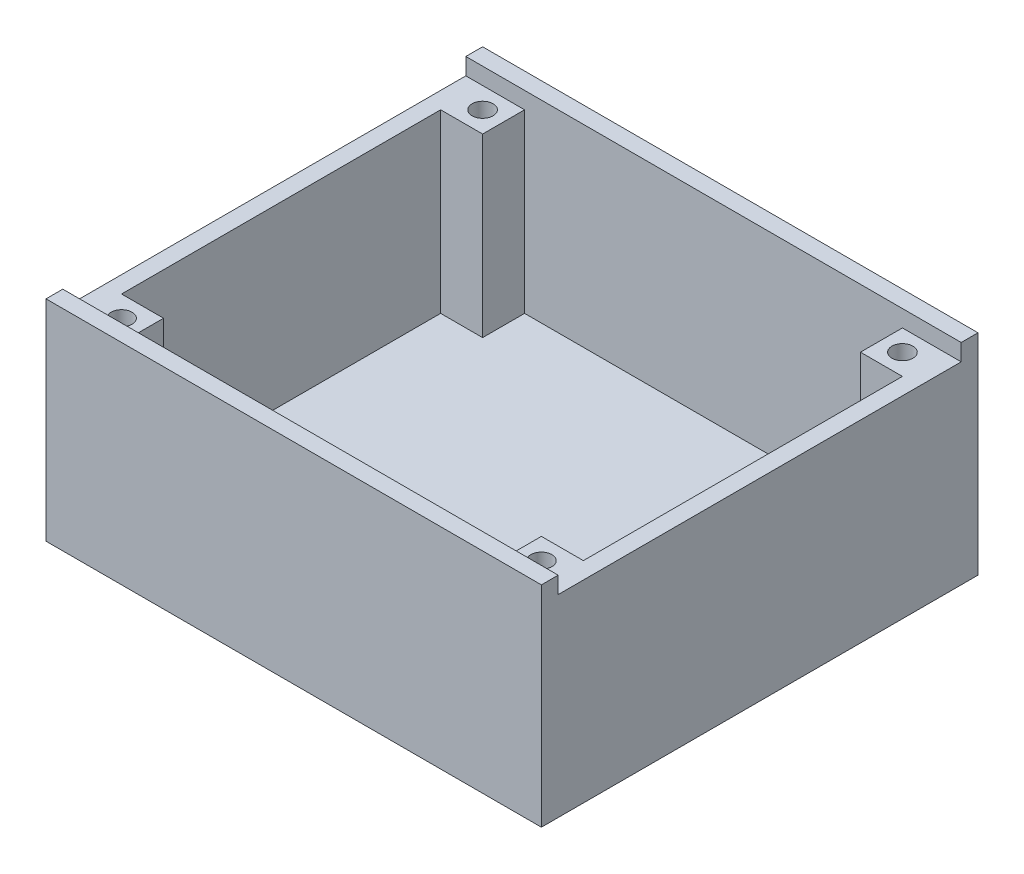
ISO-10303-21;
HEADER;
FILE_DESCRIPTION(('STEP AP214'),'2;1');
FILE_NAME('part.step','',(''),(''),'','','');
FILE_SCHEMA(('AUTOMOTIVE_DESIGN { 1 0 10303 214 1 1 1 1 }'));
ENDSEC;
DATA;
#1=APPLICATION_CONTEXT('core data for automotive mechanical design processes');
#2=APPLICATION_PROTOCOL_DEFINITION('international standard','automotive_design',2000,#1);
#3=PRODUCT_CONTEXT('',#1,'mechanical');
#4=PRODUCT('Part','Part','',(#3));
#5=PRODUCT_RELATED_PRODUCT_CATEGORY('part','',(#4));
#6=PRODUCT_DEFINITION_FORMATION('','',#4);
#7=PRODUCT_DEFINITION_CONTEXT('part definition',#1,'design');
#8=PRODUCT_DEFINITION('design','',#6,#7);
#9=PRODUCT_DEFINITION_SHAPE('','',#8);
#10=(LENGTH_UNIT() NAMED_UNIT(*) SI_UNIT(.MILLI.,.METRE.));
#11=(NAMED_UNIT(*) PLANE_ANGLE_UNIT() SI_UNIT($,.RADIAN.));
#12=(NAMED_UNIT(*) SI_UNIT($,.STERADIAN.) SOLID_ANGLE_UNIT());
#13=UNCERTAINTY_MEASURE_WITH_UNIT(LENGTH_MEASURE(1.E-05),#10,'distance_accuracy_value','');
#14=(GEOMETRIC_REPRESENTATION_CONTEXT(3) GLOBAL_UNCERTAINTY_ASSIGNED_CONTEXT((#13)) GLOBAL_UNIT_ASSIGNED_CONTEXT((#10,
#11,#12)) REPRESENTATION_CONTEXT('',''));
#15=CARTESIAN_POINT('',(0.,0.,0.));
#16=DIRECTION('',(0.,0.,1.));
#17=DIRECTION('',(1.,0.,0.));
#18=AXIS2_PLACEMENT_3D('',#15,#16,#17);
#19=CARTESIAN_POINT('',(0.,4.,0.));
#20=DIRECTION('',(0.,1.,0.));
#21=DIRECTION('',(0.,0.,1.));
#22=AXIS2_PLACEMENT_3D('',#19,#20,#21);
#23=PLANE('',#22);
#24=DIRECTION('',(0.,0.,-1.));
#25=VECTOR('',#24,1.);
#26=CARTESIAN_POINT('',(55.,4.,48.));
#27=LINE('',#26,#25);
#28=CARTESIAN_POINT('',(55.,4.,38.));
#29=VERTEX_POINT('',#28);
#30=CARTESIAN_POINT('',(55.,4.,-38.));
#31=VERTEX_POINT('',#30);
#32=EDGE_CURVE('E200',#29,#31,#27,.T.);
#33=ORIENTED_EDGE('',*,*,#32,.T.);
#34=DIRECTION('',(1.,0.,0.));
#35=VECTOR('',#34,1.);
#36=CARTESIAN_POINT('',(55.,4.,-38.));
#37=LINE('',#36,#35);
#38=CARTESIAN_POINT('',(45.,4.,-38.));
#39=VERTEX_POINT('',#38);
#40=EDGE_CURVE('E193',#39,#31,#37,.T.);
#41=ORIENTED_EDGE('',*,*,#40,.F.);
#42=DIRECTION('',(0.,0.,1.));
#43=VECTOR('',#42,1.);
#44=CARTESIAN_POINT('',(45.,4.,-48.));
#45=LINE('',#44,#43);
#46=CARTESIAN_POINT('',(45.,4.,-48.));
#47=VERTEX_POINT('',#46);
#48=EDGE_CURVE('E179',#47,#39,#45,.T.);
#49=ORIENTED_EDGE('',*,*,#48,.F.);
#50=DIRECTION('',(-1.,0.,0.));
#51=VECTOR('',#50,1.);
#52=CARTESIAN_POINT('',(-55.,4.,-48.));
#53=LINE('',#52,#51);
#54=CARTESIAN_POINT('',(-45.,4.,-48.));
#55=VERTEX_POINT('',#54);
#56=EDGE_CURVE('E191',#47,#55,#53,.T.);
#57=ORIENTED_EDGE('',*,*,#56,.T.);
#58=DIRECTION('',(0.,0.,-1.));
#59=VECTOR('',#58,1.);
#60=CARTESIAN_POINT('',(-45.,4.,-48.));
#61=LINE('',#60,#59);
#62=CARTESIAN_POINT('',(-45.,4.,-38.));
#63=VERTEX_POINT('',#62);
#64=EDGE_CURVE('E303',#63,#55,#61,.T.);
#65=ORIENTED_EDGE('',*,*,#64,.F.);
#66=DIRECTION('',(1.,0.,0.));
#67=VECTOR('',#66,1.);
#68=CARTESIAN_POINT('',(-55.,4.,-38.));
#69=LINE('',#68,#67);
#70=CARTESIAN_POINT('',(-55.,4.,-38.));
#71=VERTEX_POINT('',#70);
#72=EDGE_CURVE('E305',#71,#63,#69,.T.);
#73=ORIENTED_EDGE('',*,*,#72,.F.);
#74=DIRECTION('',(0.,0.,1.));
#75=VECTOR('',#74,1.);
#76=CARTESIAN_POINT('',(-55.,4.,48.));
#77=LINE('',#76,#75);
#78=CARTESIAN_POINT('',(-55.,4.,38.));
#79=VERTEX_POINT('',#78);
#80=EDGE_CURVE('E201',#71,#79,#77,.T.);
#81=ORIENTED_EDGE('',*,*,#80,.T.);
#82=DIRECTION('',(-1.,0.,0.));
#83=VECTOR('',#82,1.);
#84=CARTESIAN_POINT('',(-55.,4.,38.));
#85=LINE('',#84,#83);
#86=CARTESIAN_POINT('',(-45.,4.,38.));
#87=VERTEX_POINT('',#86);
#88=EDGE_CURVE('E320',#87,#79,#85,.T.);
#89=ORIENTED_EDGE('',*,*,#88,.F.);
#90=DIRECTION('',(0.,0.,-1.));
#91=VECTOR('',#90,1.);
#92=CARTESIAN_POINT('',(-45.,4.,48.));
#93=LINE('',#92,#91);
#94=CARTESIAN_POINT('',(-45.,4.,48.));
#95=VERTEX_POINT('',#94);
#96=EDGE_CURVE('E322',#95,#87,#93,.T.);
#97=ORIENTED_EDGE('',*,*,#96,.F.);
#98=DIRECTION('',(1.,0.,0.));
#99=VECTOR('',#98,1.);
#100=CARTESIAN_POINT('',(-55.,4.,48.));
#101=LINE('',#100,#99);
#102=CARTESIAN_POINT('',(45.,4.,48.));
#103=VERTEX_POINT('',#102);
#104=EDGE_CURVE('E11',#95,#103,#101,.T.);
#105=ORIENTED_EDGE('',*,*,#104,.T.);
#106=DIRECTION('',(0.,0.,1.));
#107=VECTOR('',#106,1.);
#108=CARTESIAN_POINT('',(45.,4.,48.));
#109=LINE('',#108,#107);
#110=CARTESIAN_POINT('',(45.,4.,38.));
#111=VERTEX_POINT('',#110);
#112=EDGE_CURVE('E338',#111,#103,#109,.T.);
#113=ORIENTED_EDGE('',*,*,#112,.F.);
#114=DIRECTION('',(-1.,0.,0.));
#115=VECTOR('',#114,1.);
#116=CARTESIAN_POINT('',(55.,4.,38.));
#117=LINE('',#116,#115);
#118=EDGE_CURVE('E340',#29,#111,#117,.T.);
#119=ORIENTED_EDGE('',*,*,#118,.F.);
#120=EDGE_LOOP('',(#33,#41,#49,#57,#65,#73,#81,#89,#97,#105,#113,#119));
#121=FACE_BOUND('',#120,.T.);
#122=ADVANCED_FACE('F35',(#121),#23,.T.);
#123=CARTESIAN_POINT('',(55.,50.,48.));
#124=DIRECTION('',(-1.,0.,0.));
#125=DIRECTION('',(0.,0.,1.));
#126=AXIS2_PLACEMENT_3D('',#123,#124,#125);
#127=PLANE('',#126);
#128=DIRECTION('',(0.,0.,1.));
#129=VECTOR('',#128,1.);
#130=CARTESIAN_POINT('',(55.,46.,48.));
#131=LINE('',#130,#129);
#132=CARTESIAN_POINT('',(55.,46.,-38.));
#133=VERTEX_POINT('',#132);
#134=CARTESIAN_POINT('',(55.,46.,38.));
#135=VERTEX_POINT('',#134);
#136=EDGE_CURVE('E278',#133,#135,#131,.T.);
#137=ORIENTED_EDGE('',*,*,#136,.F.);
#138=DIRECTION('',(0.,-1.,0.));
#139=VECTOR('',#138,1.);
#140=CARTESIAN_POINT('',(55.,60.142135623731,-38.));
#141=LINE('',#140,#139);
#142=EDGE_CURVE('E50',#133,#31,#141,.T.);
#143=ORIENTED_EDGE('',*,*,#142,.T.);
#144=ORIENTED_EDGE('',*,*,#32,.F.);
#145=DIRECTION('',(0.,-1.,0.));
#146=VECTOR('',#145,1.);
#147=CARTESIAN_POINT('',(55.,60.142135623731,38.));
#148=LINE('',#147,#146);
#149=EDGE_CURVE('E331',#135,#29,#148,.T.);
#150=ORIENTED_EDGE('',*,*,#149,.F.);
#151=EDGE_LOOP('',(#137,#143,#144,#150));
#152=FACE_BOUND('',#151,.T.);
#153=ADVANCED_FACE('F424',(#152),#127,.T.);
#154=CARTESIAN_POINT('',(-55.,50.,-48.));
#155=DIRECTION('',(0.,0.,1.));
#156=DIRECTION('',(1.,0.,0.));
#157=AXIS2_PLACEMENT_3D('',#154,#155,#156);
#158=PLANE('',#157);
#159=ORIENTED_EDGE('',*,*,#56,.F.);
#160=DIRECTION('',(0.,-1.,0.));
#161=VECTOR('',#160,1.);
#162=CARTESIAN_POINT('',(45.,60.142135623731,-48.));
#163=LINE('',#162,#161);
#164=CARTESIAN_POINT('',(45.,46.,-48.));
#165=VERTEX_POINT('',#164);
#166=EDGE_CURVE('E175',#165,#47,#163,.T.);
#167=ORIENTED_EDGE('',*,*,#166,.F.);
#168=DIRECTION('',(1.,0.,0.));
#169=VECTOR('',#168,1.);
#170=CARTESIAN_POINT('',(-59.,46.,-48.));
#171=LINE('',#170,#169);
#172=CARTESIAN_POINT('',(59.,46.,-48.));
#173=VERTEX_POINT('',#172);
#174=EDGE_CURVE('E287',#165,#173,#171,.T.);
#175=ORIENTED_EDGE('',*,*,#174,.T.);
#176=DIRECTION('',(0.,-1.,0.));
#177=VECTOR('',#176,1.);
#178=CARTESIAN_POINT('',(59.,50.,-48.));
#179=LINE('',#178,#177);
#180=CARTESIAN_POINT('',(59.,50.,-48.));
#181=VERTEX_POINT('',#180);
#182=EDGE_CURVE('E275',#181,#173,#179,.T.);
#183=ORIENTED_EDGE('',*,*,#182,.F.);
#184=DIRECTION('',(-1.,0.,0.));
#185=VECTOR('',#184,1.);
#186=CARTESIAN_POINT('',(-55.,50.,-48.));
#187=LINE('',#186,#185);
#188=CARTESIAN_POINT('',(-59.,50.,-48.));
#189=VERTEX_POINT('',#188);
#190=EDGE_CURVE('E203',#181,#189,#187,.T.);
#191=ORIENTED_EDGE('',*,*,#190,.T.);
#192=DIRECTION('',(0.,1.,0.));
#193=VECTOR('',#192,1.);
#194=CARTESIAN_POINT('',(-59.,50.,-48.));
#195=LINE('',#194,#193);
#196=CARTESIAN_POINT('',(-59.,46.,-48.));
#197=VERTEX_POINT('',#196);
#198=EDGE_CURVE('E270',#197,#189,#195,.T.);
#199=ORIENTED_EDGE('',*,*,#198,.F.);
#200=CARTESIAN_POINT('',(-45.,46.,-48.));
#201=VERTEX_POINT('',#200);
#202=EDGE_CURVE('E284',#197,#201,#171,.T.);
#203=ORIENTED_EDGE('',*,*,#202,.T.);
#204=DIRECTION('',(0.,-1.,0.));
#205=VECTOR('',#204,1.);
#206=CARTESIAN_POINT('',(-45.,60.142135623731,-48.));
#207=LINE('',#206,#205);
#208=EDGE_CURVE('E199',#201,#55,#207,.T.);
#209=ORIENTED_EDGE('',*,*,#208,.T.);
#210=EDGE_LOOP('',(#159,#167,#175,#183,#191,#199,#203,#209));
#211=FACE_BOUND('',#210,.T.);
#212=ADVANCED_FACE('F197',(#211),#158,.T.);
#213=CARTESIAN_POINT('',(-55.,50.,48.));
#214=DIRECTION('',(0.,0.,-1.));
#215=DIRECTION('',(-1.,0.,0.));
#216=AXIS2_PLACEMENT_3D('',#213,#214,#215);
#217=PLANE('',#216);
#218=DIRECTION('',(1.,0.,0.));
#219=VECTOR('',#218,1.);
#220=CARTESIAN_POINT('',(-59.,46.,48.));
#221=LINE('',#220,#219);
#222=CARTESIAN_POINT('',(45.,46.,48.));
#223=VERTEX_POINT('',#222);
#224=CARTESIAN_POINT('',(59.,46.,48.));
#225=VERTEX_POINT('',#224);
#226=EDGE_CURVE('E288',#223,#225,#221,.T.);
#227=ORIENTED_EDGE('',*,*,#226,.F.);
#228=DIRECTION('',(0.,-1.,0.));
#229=VECTOR('',#228,1.);
#230=CARTESIAN_POINT('',(45.,60.142135623731,48.));
#231=LINE('',#230,#229);
#232=EDGE_CURVE('E335',#223,#103,#231,.T.);
#233=ORIENTED_EDGE('',*,*,#232,.T.);
#234=ORIENTED_EDGE('',*,*,#104,.F.);
#235=DIRECTION('',(0.,-1.,0.));
#236=VECTOR('',#235,1.);
#237=CARTESIAN_POINT('',(-45.,60.142135623731,48.));
#238=LINE('',#237,#236);
#239=CARTESIAN_POINT('',(-45.,46.,48.));
#240=VERTEX_POINT('',#239);
#241=EDGE_CURVE('E315',#240,#95,#238,.T.);
#242=ORIENTED_EDGE('',*,*,#241,.F.);
#243=CARTESIAN_POINT('',(-59.,46.,48.));
#244=VERTEX_POINT('',#243);
#245=EDGE_CURVE('E285',#244,#240,#221,.T.);
#246=ORIENTED_EDGE('',*,*,#245,.F.);
#247=DIRECTION('',(0.,-1.,0.));
#248=VECTOR('',#247,1.);
#249=CARTESIAN_POINT('',(-59.,50.,48.));
#250=LINE('',#249,#248);
#251=CARTESIAN_POINT('',(-59.,50.,48.));
#252=VERTEX_POINT('',#251);
#253=EDGE_CURVE('E293',#252,#244,#250,.T.);
#254=ORIENTED_EDGE('',*,*,#253,.F.);
#255=DIRECTION('',(1.,0.,0.));
#256=VECTOR('',#255,1.);
#257=CARTESIAN_POINT('',(-55.,50.,48.));
#258=LINE('',#257,#256);
#259=CARTESIAN_POINT('',(59.,50.,48.));
#260=VERTEX_POINT('',#259);
#261=EDGE_CURVE('E211',#252,#260,#258,.T.);
#262=ORIENTED_EDGE('',*,*,#261,.T.);
#263=DIRECTION('',(0.,1.,0.));
#264=VECTOR('',#263,1.);
#265=CARTESIAN_POINT('',(59.,50.,48.));
#266=LINE('',#265,#264);
#267=EDGE_CURVE('E206',#225,#260,#266,.T.);
#268=ORIENTED_EDGE('',*,*,#267,.F.);
#269=EDGE_LOOP('',(#227,#233,#234,#242,#246,#254,#262,#268));
#270=FACE_BOUND('',#269,.T.);
#271=ADVANCED_FACE('F393',(#270),#217,.T.);
#272=CARTESIAN_POINT('',(-55.,50.,48.));
#273=DIRECTION('',(1.,0.,0.));
#274=DIRECTION('',(0.,0.,-1.));
#275=AXIS2_PLACEMENT_3D('',#272,#273,#274);
#276=PLANE('',#275);
#277=DIRECTION('',(0.,0.,-1.));
#278=VECTOR('',#277,1.);
#279=CARTESIAN_POINT('',(-55.,46.,48.));
#280=LINE('',#279,#278);
#281=CARTESIAN_POINT('',(-55.,46.,38.));
#282=VERTEX_POINT('',#281);
#283=CARTESIAN_POINT('',(-55.,46.,-38.));
#284=VERTEX_POINT('',#283);
#285=EDGE_CURVE('E282',#282,#284,#280,.T.);
#286=ORIENTED_EDGE('',*,*,#285,.F.);
#287=DIRECTION('',(0.,-1.,0.));
#288=VECTOR('',#287,1.);
#289=CARTESIAN_POINT('',(-55.,60.142135623731,38.));
#290=LINE('',#289,#288);
#291=EDGE_CURVE('E58',#282,#79,#290,.T.);
#292=ORIENTED_EDGE('',*,*,#291,.T.);
#293=ORIENTED_EDGE('',*,*,#80,.F.);
#294=DIRECTION('',(0.,-1.,0.));
#295=VECTOR('',#294,1.);
#296=CARTESIAN_POINT('',(-55.,60.142135623731,-38.));
#297=LINE('',#296,#295);
#298=EDGE_CURVE('E297',#284,#71,#297,.T.);
#299=ORIENTED_EDGE('',*,*,#298,.F.);
#300=EDGE_LOOP('',(#286,#292,#293,#299));
#301=FACE_BOUND('',#300,.T.);
#302=ADVANCED_FACE('F411',(#301),#276,.T.);
#303=CARTESIAN_POINT('',(0.,50.,0.));
#304=DIRECTION('',(0.,-1.,0.));
#305=DIRECTION('',(0.,0.,-1.));
#306=AXIS2_PLACEMENT_3D('',#303,#304,#305);
#307=PLANE('',#306);
#308=DIRECTION('',(0.,0.,-1.));
#309=VECTOR('',#308,1.);
#310=CARTESIAN_POINT('',(59.,50.,52.));
#311=LINE('',#310,#309);
#312=CARTESIAN_POINT('',(59.,50.,52.));
#313=VERTEX_POINT('',#312);
#314=EDGE_CURVE('E214',#313,#260,#311,.T.);
#315=ORIENTED_EDGE('',*,*,#314,.T.);
#316=ORIENTED_EDGE('',*,*,#261,.F.);
#317=DIRECTION('',(0.,0.,1.));
#318=VECTOR('',#317,1.);
#319=CARTESIAN_POINT('',(-59.,50.,52.));
#320=LINE('',#319,#318);
#321=CARTESIAN_POINT('',(-59.,50.,52.));
#322=VERTEX_POINT('',#321);
#323=EDGE_CURVE('E220',#252,#322,#320,.T.);
#324=ORIENTED_EDGE('',*,*,#323,.T.);
#325=DIRECTION('',(1.,0.,0.));
#326=VECTOR('',#325,1.);
#327=CARTESIAN_POINT('',(-59.,50.,52.));
#328=LINE('',#327,#326);
#329=EDGE_CURVE('E224',#322,#313,#328,.T.);
#330=ORIENTED_EDGE('',*,*,#329,.T.);
#331=EDGE_LOOP('',(#315,#316,#324,#330));
#332=FACE_BOUND('',#331,.T.);
#333=ADVANCED_FACE('F397',(#332),#307,.F.);
#334=CARTESIAN_POINT('',(-59.,50.,-52.));
#335=VERTEX_POINT('',#334);
#336=EDGE_CURVE('E221',#335,#189,#320,.T.);
#337=ORIENTED_EDGE('',*,*,#336,.T.);
#338=ORIENTED_EDGE('',*,*,#190,.F.);
#339=CARTESIAN_POINT('',(59.,50.,-52.));
#340=VERTEX_POINT('',#339);
#341=EDGE_CURVE('E218',#181,#340,#311,.T.);
#342=ORIENTED_EDGE('',*,*,#341,.T.);
#343=DIRECTION('',(-1.,0.,0.));
#344=VECTOR('',#343,1.);
#345=CARTESIAN_POINT('',(-59.,50.,-52.));
#346=LINE('',#345,#344);
#347=EDGE_CURVE('E217',#340,#335,#346,.T.);
#348=ORIENTED_EDGE('',*,*,#347,.T.);
#349=EDGE_LOOP('',(#337,#338,#342,#348));
#350=FACE_BOUND('',#349,.T.);
#351=ADVANCED_FACE('F272',(#350),#307,.F.);
#352=CARTESIAN_POINT('',(0.,0.,0.));
#353=DIRECTION('',(0.,-1.,0.));
#354=DIRECTION('',(0.,0.,-1.));
#355=AXIS2_PLACEMENT_3D('',#352,#353,#354);
#356=PLANE('',#355);
#357=DIRECTION('',(0.,0.,-1.));
#358=VECTOR('',#357,1.);
#359=CARTESIAN_POINT('',(59.,0.,52.));
#360=LINE('',#359,#358);
#361=CARTESIAN_POINT('',(59.,0.,52.));
#362=VERTEX_POINT('',#361);
#363=CARTESIAN_POINT('',(59.,0.,-52.));
#364=VERTEX_POINT('',#363);
#365=EDGE_CURVE('E213',#362,#364,#360,.T.);
#366=ORIENTED_EDGE('',*,*,#365,.F.);
#367=DIRECTION('',(1.,0.,0.));
#368=VECTOR('',#367,1.);
#369=CARTESIAN_POINT('',(-59.,0.,52.));
#370=LINE('',#369,#368);
#371=CARTESIAN_POINT('',(-59.,0.,52.));
#372=VERTEX_POINT('',#371);
#373=EDGE_CURVE('E235',#372,#362,#370,.T.);
#374=ORIENTED_EDGE('',*,*,#373,.F.);
#375=DIRECTION('',(0.,0.,1.));
#376=VECTOR('',#375,1.);
#377=CARTESIAN_POINT('',(-59.,0.,52.));
#378=LINE('',#377,#376);
#379=CARTESIAN_POINT('',(-59.,0.,-52.));
#380=VERTEX_POINT('',#379);
#381=EDGE_CURVE('E232',#380,#372,#378,.T.);
#382=ORIENTED_EDGE('',*,*,#381,.F.);
#383=DIRECTION('',(-1.,0.,0.));
#384=VECTOR('',#383,1.);
#385=CARTESIAN_POINT('',(-59.,0.,-52.));
#386=LINE('',#385,#384);
#387=EDGE_CURVE('E229',#364,#380,#386,.T.);
#388=ORIENTED_EDGE('',*,*,#387,.F.);
#389=EDGE_LOOP('',(#366,#374,#382,#388));
#390=FACE_BOUND('',#389,.T.);
#391=ADVANCED_FACE('F253',(#390),#356,.T.);
#392=CARTESIAN_POINT('',(59.,50.,52.));
#393=DIRECTION('',(-1.,0.,0.));
#394=DIRECTION('',(0.,0.,1.));
#395=AXIS2_PLACEMENT_3D('',#392,#393,#394);
#396=PLANE('',#395);
#397=DIRECTION('',(0.,0.,1.));
#398=VECTOR('',#397,1.);
#399=CARTESIAN_POINT('',(59.,46.,52.));
#400=LINE('',#399,#398);
#401=EDGE_CURVE('E276',#173,#225,#400,.T.);
#402=ORIENTED_EDGE('',*,*,#401,.T.);
#403=ORIENTED_EDGE('',*,*,#267,.T.);
#404=ORIENTED_EDGE('',*,*,#314,.F.);
#405=DIRECTION('',(0.,-1.,0.));
#406=VECTOR('',#405,1.);
#407=CARTESIAN_POINT('',(59.,50.,52.));
#408=LINE('',#407,#406);
#409=EDGE_CURVE('E226',#313,#362,#408,.T.);
#410=ORIENTED_EDGE('',*,*,#409,.T.);
#411=ORIENTED_EDGE('',*,*,#365,.T.);
#412=DIRECTION('',(0.,-1.,0.));
#413=VECTOR('',#412,1.);
#414=CARTESIAN_POINT('',(59.,50.,-52.));
#415=LINE('',#414,#413);
#416=EDGE_CURVE('E43',#340,#364,#415,.T.);
#417=ORIENTED_EDGE('',*,*,#416,.F.);
#418=ORIENTED_EDGE('',*,*,#341,.F.);
#419=ORIENTED_EDGE('',*,*,#182,.T.);
#420=EDGE_LOOP('',(#402,#403,#404,#410,#411,#417,#418,#419));
#421=FACE_BOUND('',#420,.T.);
#422=ADVANCED_FACE('F37',(#421),#396,.F.);
#423=CARTESIAN_POINT('',(-59.,50.,-52.));
#424=DIRECTION('',(0.,0.,1.));
#425=DIRECTION('',(1.,0.,0.));
#426=AXIS2_PLACEMENT_3D('',#423,#424,#425);
#427=PLANE('',#426);
#428=ORIENTED_EDGE('',*,*,#416,.T.);
#429=ORIENTED_EDGE('',*,*,#387,.T.);
#430=DIRECTION('',(0.,-1.,0.));
#431=VECTOR('',#430,1.);
#432=CARTESIAN_POINT('',(-59.,50.,-52.));
#433=LINE('',#432,#431);
#434=EDGE_CURVE('E241',#335,#380,#433,.T.);
#435=ORIENTED_EDGE('',*,*,#434,.F.);
#436=ORIENTED_EDGE('',*,*,#347,.F.);
#437=EDGE_LOOP('',(#428,#429,#435,#436));
#438=FACE_BOUND('',#437,.T.);
#439=ADVANCED_FACE('F246',(#438),#427,.F.);
#440=CARTESIAN_POINT('',(-59.,50.,52.));
#441=DIRECTION('',(1.,0.,0.));
#442=DIRECTION('',(0.,0.,-1.));
#443=AXIS2_PLACEMENT_3D('',#440,#441,#442);
#444=PLANE('',#443);
#445=ORIENTED_EDGE('',*,*,#323,.F.);
#446=ORIENTED_EDGE('',*,*,#253,.T.);
#447=DIRECTION('',(0.,0.,-1.));
#448=VECTOR('',#447,1.);
#449=CARTESIAN_POINT('',(-59.,46.,48.));
#450=LINE('',#449,#448);
#451=EDGE_CURVE('E291',#244,#197,#450,.T.);
#452=ORIENTED_EDGE('',*,*,#451,.T.);
#453=ORIENTED_EDGE('',*,*,#198,.T.);
#454=ORIENTED_EDGE('',*,*,#336,.F.);
#455=ORIENTED_EDGE('',*,*,#434,.T.);
#456=ORIENTED_EDGE('',*,*,#381,.T.);
#457=DIRECTION('',(0.,-1.,0.));
#458=VECTOR('',#457,1.);
#459=CARTESIAN_POINT('',(-59.,50.,52.));
#460=LINE('',#459,#458);
#461=EDGE_CURVE('E239',#322,#372,#460,.T.);
#462=ORIENTED_EDGE('',*,*,#461,.F.);
#463=EDGE_LOOP('',(#445,#446,#452,#453,#454,#455,#456,#462));
#464=FACE_BOUND('',#463,.T.);
#465=ADVANCED_FACE('F265',(#464),#444,.F.);
#466=CARTESIAN_POINT('',(-59.,50.,52.));
#467=DIRECTION('',(0.,0.,-1.));
#468=DIRECTION('',(-1.,0.,0.));
#469=AXIS2_PLACEMENT_3D('',#466,#467,#468);
#470=PLANE('',#469);
#471=ORIENTED_EDGE('',*,*,#461,.T.);
#472=ORIENTED_EDGE('',*,*,#373,.T.);
#473=ORIENTED_EDGE('',*,*,#409,.F.);
#474=ORIENTED_EDGE('',*,*,#329,.F.);
#475=EDGE_LOOP('',(#471,#472,#473,#474));
#476=FACE_BOUND('',#475,.T.);
#477=ADVANCED_FACE('F261',(#476),#470,.F.);
#478=CARTESIAN_POINT('',(-59.,46.,48.));
#479=DIRECTION('',(0.,-1.,0.));
#480=DIRECTION('',(0.,0.,-1.));
#481=AXIS2_PLACEMENT_3D('',#478,#479,#480);
#482=PLANE('',#481);
#483=CARTESIAN_POINT('',(-50.,46.,43.));
#484=DIRECTION('',(0.,1.,0.));
#485=DIRECTION('',(0.,0.,-1.));
#486=AXIS2_PLACEMENT_3D('',#483,#484,#485);
#487=CIRCLE('',#486,2.5);
#488=CARTESIAN_POINT('',(-50.,46.,40.5));
#489=VERTEX_POINT('',#488);
#490=EDGE_CURVE('E356',#489,#489,#487,.T.);
#491=ORIENTED_EDGE('',*,*,#490,.F.);
#492=EDGE_LOOP('',(#491));
#493=FACE_BOUND('',#492,.T.);
#494=CARTESIAN_POINT('',(-50.,46.,-43.));
#495=DIRECTION('',(0.,1.,0.));
#496=DIRECTION('',(0.,0.,1.));
#497=AXIS2_PLACEMENT_3D('',#494,#495,#496);
#498=CIRCLE('',#497,2.5);
#499=CARTESIAN_POINT('',(-50.,46.,-40.5));
#500=VERTEX_POINT('',#499);
#501=EDGE_CURVE('E350',#500,#500,#498,.T.);
#502=ORIENTED_EDGE('',*,*,#501,.F.);
#503=EDGE_LOOP('',(#502));
#504=FACE_BOUND('',#503,.T.);
#505=ORIENTED_EDGE('',*,*,#245,.T.);
#506=DIRECTION('',(0.,0.,1.));
#507=VECTOR('',#506,1.);
#508=CARTESIAN_POINT('',(-45.,46.,48.));
#509=LINE('',#508,#507);
#510=CARTESIAN_POINT('',(-45.,46.,38.));
#511=VERTEX_POINT('',#510);
#512=EDGE_CURVE('E308',#511,#240,#509,.T.);
#513=ORIENTED_EDGE('',*,*,#512,.F.);
#514=DIRECTION('',(1.,0.,0.));
#515=VECTOR('',#514,1.);
#516=CARTESIAN_POINT('',(-55.,46.,38.));
#517=LINE('',#516,#515);
#518=EDGE_CURVE('E313',#282,#511,#517,.T.);
#519=ORIENTED_EDGE('',*,*,#518,.F.);
#520=ORIENTED_EDGE('',*,*,#285,.T.);
#521=DIRECTION('',(-1.,0.,0.));
#522=VECTOR('',#521,1.);
#523=CARTESIAN_POINT('',(-55.,46.,-38.));
#524=LINE('',#523,#522);
#525=CARTESIAN_POINT('',(-45.,46.,-38.));
#526=VERTEX_POINT('',#525);
#527=EDGE_CURVE('E296',#526,#284,#524,.T.);
#528=ORIENTED_EDGE('',*,*,#527,.F.);
#529=DIRECTION('',(0.,0.,1.));
#530=VECTOR('',#529,1.);
#531=CARTESIAN_POINT('',(-45.,46.,-48.));
#532=LINE('',#531,#530);
#533=EDGE_CURVE('E299',#201,#526,#532,.T.);
#534=ORIENTED_EDGE('',*,*,#533,.F.);
#535=ORIENTED_EDGE('',*,*,#202,.F.);
#536=ORIENTED_EDGE('',*,*,#451,.F.);
#537=EDGE_LOOP('',(#505,#513,#519,#520,#528,#534,#535,#536));
#538=FACE_BOUND('',#537,.T.);
#539=ADVANCED_FACE('F386',(#493,#504,#538),#482,.F.);
#540=CARTESIAN_POINT('',(50.,46.,43.));
#541=DIRECTION('',(0.,1.,0.));
#542=DIRECTION('',(0.,0.,1.));
#543=AXIS2_PLACEMENT_3D('',#540,#541,#542);
#544=CIRCLE('',#543,2.5);
#545=CARTESIAN_POINT('',(50.,46.,45.5));
#546=VERTEX_POINT('',#545);
#547=EDGE_CURVE('E362',#546,#546,#544,.T.);
#548=ORIENTED_EDGE('',*,*,#547,.F.);
#549=EDGE_LOOP('',(#548));
#550=FACE_BOUND('',#549,.T.);
#551=CARTESIAN_POINT('',(50.,46.,-43.));
#552=DIRECTION('',(0.,1.,0.));
#553=DIRECTION('',(0.,0.,-1.));
#554=AXIS2_PLACEMENT_3D('',#551,#552,#553);
#555=CIRCLE('',#554,2.5);
#556=CARTESIAN_POINT('',(50.,46.,-45.5));
#557=VERTEX_POINT('',#556);
#558=EDGE_CURVE('E368',#557,#557,#555,.T.);
#559=ORIENTED_EDGE('',*,*,#558,.F.);
#560=EDGE_LOOP('',(#559));
#561=FACE_BOUND('',#560,.T.);
#562=ORIENTED_EDGE('',*,*,#174,.F.);
#563=DIRECTION('',(0.,0.,-1.));
#564=VECTOR('',#563,1.);
#565=CARTESIAN_POINT('',(45.,46.,-48.));
#566=LINE('',#565,#564);
#567=CARTESIAN_POINT('',(45.,46.,-38.));
#568=VERTEX_POINT('',#567);
#569=EDGE_CURVE('E181',#568,#165,#566,.T.);
#570=ORIENTED_EDGE('',*,*,#569,.F.);
#571=DIRECTION('',(-1.,0.,0.));
#572=VECTOR('',#571,1.);
#573=CARTESIAN_POINT('',(55.,46.,-38.));
#574=LINE('',#573,#572);
#575=EDGE_CURVE('E185',#133,#568,#574,.T.);
#576=ORIENTED_EDGE('',*,*,#575,.F.);
#577=ORIENTED_EDGE('',*,*,#136,.T.);
#578=DIRECTION('',(1.,0.,0.));
#579=VECTOR('',#578,1.);
#580=CARTESIAN_POINT('',(55.,46.,38.));
#581=LINE('',#580,#579);
#582=CARTESIAN_POINT('',(45.,46.,38.));
#583=VERTEX_POINT('',#582);
#584=EDGE_CURVE('E325',#583,#135,#581,.T.);
#585=ORIENTED_EDGE('',*,*,#584,.F.);
#586=DIRECTION('',(0.,0.,-1.));
#587=VECTOR('',#586,1.);
#588=CARTESIAN_POINT('',(45.,46.,48.));
#589=LINE('',#588,#587);
#590=EDGE_CURVE('E328',#223,#583,#589,.T.);
#591=ORIENTED_EDGE('',*,*,#590,.F.);
#592=ORIENTED_EDGE('',*,*,#226,.T.);
#593=ORIENTED_EDGE('',*,*,#401,.F.);
#594=EDGE_LOOP('',(#562,#570,#576,#577,#585,#591,#592,#593));
#595=FACE_BOUND('',#594,.T.);
#596=ADVANCED_FACE('F382',(#550,#561,#595),#482,.F.);
#597=CARTESIAN_POINT('',(-45.,60.142135623731,-48.));
#598=DIRECTION('',(-1.,0.,0.));
#599=DIRECTION('',(0.,0.,1.));
#600=AXIS2_PLACEMENT_3D('',#597,#598,#599);
#601=PLANE('',#600);
#602=ORIENTED_EDGE('',*,*,#208,.F.);
#603=ORIENTED_EDGE('',*,*,#533,.T.);
#604=DIRECTION('',(0.,-1.,0.));
#605=VECTOR('',#604,1.);
#606=CARTESIAN_POINT('',(-45.,60.142135623731,-38.));
#607=LINE('',#606,#605);
#608=EDGE_CURVE('E300',#526,#63,#607,.T.);
#609=ORIENTED_EDGE('',*,*,#608,.T.);
#610=ORIENTED_EDGE('',*,*,#64,.T.);
#611=EDGE_LOOP('',(#602,#603,#609,#610));
#612=FACE_BOUND('',#611,.T.);
#613=ADVANCED_FACE('F385',(#612),#601,.F.);
#614=CARTESIAN_POINT('',(-55.,60.142135623731,-38.));
#615=DIRECTION('',(0.,0.,-1.));
#616=DIRECTION('',(-1.,0.,0.));
#617=AXIS2_PLACEMENT_3D('',#614,#615,#616);
#618=PLANE('',#617);
#619=ORIENTED_EDGE('',*,*,#608,.F.);
#620=ORIENTED_EDGE('',*,*,#527,.T.);
#621=ORIENTED_EDGE('',*,*,#298,.T.);
#622=ORIENTED_EDGE('',*,*,#72,.T.);
#623=EDGE_LOOP('',(#619,#620,#621,#622));
#624=FACE_BOUND('',#623,.T.);
#625=ADVANCED_FACE('F412',(#624),#618,.F.);
#626=CARTESIAN_POINT('',(-55.,60.142135623731,38.));
#627=DIRECTION('',(0.,0.,1.));
#628=DIRECTION('',(1.,0.,0.));
#629=AXIS2_PLACEMENT_3D('',#626,#627,#628);
#630=PLANE('',#629);
#631=ORIENTED_EDGE('',*,*,#291,.F.);
#632=ORIENTED_EDGE('',*,*,#518,.T.);
#633=DIRECTION('',(0.,-1.,0.));
#634=VECTOR('',#633,1.);
#635=CARTESIAN_POINT('',(-45.,60.142135623731,38.));
#636=LINE('',#635,#634);
#637=EDGE_CURVE('E317',#511,#87,#636,.T.);
#638=ORIENTED_EDGE('',*,*,#637,.T.);
#639=ORIENTED_EDGE('',*,*,#88,.T.);
#640=EDGE_LOOP('',(#631,#632,#638,#639));
#641=FACE_BOUND('',#640,.T.);
#642=ADVANCED_FACE('F414',(#641),#630,.F.);
#643=CARTESIAN_POINT('',(-45.,60.142135623731,48.));
#644=DIRECTION('',(-1.,0.,0.));
#645=DIRECTION('',(0.,0.,1.));
#646=AXIS2_PLACEMENT_3D('',#643,#644,#645);
#647=PLANE('',#646);
#648=ORIENTED_EDGE('',*,*,#637,.F.);
#649=ORIENTED_EDGE('',*,*,#512,.T.);
#650=ORIENTED_EDGE('',*,*,#241,.T.);
#651=ORIENTED_EDGE('',*,*,#96,.T.);
#652=EDGE_LOOP('',(#648,#649,#650,#651));
#653=FACE_BOUND('',#652,.T.);
#654=ADVANCED_FACE('F420',(#653),#647,.F.);
#655=CARTESIAN_POINT('',(45.,60.142135623731,48.));
#656=DIRECTION('',(1.,0.,0.));
#657=DIRECTION('',(0.,0.,-1.));
#658=AXIS2_PLACEMENT_3D('',#655,#656,#657);
#659=PLANE('',#658);
#660=ORIENTED_EDGE('',*,*,#232,.F.);
#661=ORIENTED_EDGE('',*,*,#590,.T.);
#662=DIRECTION('',(0.,-1.,0.));
#663=VECTOR('',#662,1.);
#664=CARTESIAN_POINT('',(45.,60.142135623731,38.));
#665=LINE('',#664,#663);
#666=EDGE_CURVE('E333',#583,#111,#665,.T.);
#667=ORIENTED_EDGE('',*,*,#666,.T.);
#668=ORIENTED_EDGE('',*,*,#112,.T.);
#669=EDGE_LOOP('',(#660,#661,#667,#668));
#670=FACE_BOUND('',#669,.T.);
#671=ADVANCED_FACE('F539',(#670),#659,.F.);
#672=CARTESIAN_POINT('',(55.,60.142135623731,38.));
#673=DIRECTION('',(0.,0.,1.));
#674=DIRECTION('',(1.,0.,0.));
#675=AXIS2_PLACEMENT_3D('',#672,#673,#674);
#676=PLANE('',#675);
#677=ORIENTED_EDGE('',*,*,#666,.F.);
#678=ORIENTED_EDGE('',*,*,#584,.T.);
#679=ORIENTED_EDGE('',*,*,#149,.T.);
#680=ORIENTED_EDGE('',*,*,#118,.T.);
#681=EDGE_LOOP('',(#677,#678,#679,#680));
#682=FACE_BOUND('',#681,.T.);
#683=ADVANCED_FACE('F549',(#682),#676,.F.);
#684=CARTESIAN_POINT('',(55.,60.142135623731,-38.));
#685=DIRECTION('',(0.,0.,-1.));
#686=DIRECTION('',(-1.,0.,0.));
#687=AXIS2_PLACEMENT_3D('',#684,#685,#686);
#688=PLANE('',#687);
#689=ORIENTED_EDGE('',*,*,#142,.F.);
#690=ORIENTED_EDGE('',*,*,#575,.T.);
#691=DIRECTION('',(0.,-1.,0.));
#692=VECTOR('',#691,1.);
#693=CARTESIAN_POINT('',(45.,60.142135623731,-38.));
#694=LINE('',#693,#692);
#695=EDGE_CURVE('E186',#568,#39,#694,.T.);
#696=ORIENTED_EDGE('',*,*,#695,.T.);
#697=ORIENTED_EDGE('',*,*,#40,.T.);
#698=EDGE_LOOP('',(#689,#690,#696,#697));
#699=FACE_BOUND('',#698,.T.);
#700=ADVANCED_FACE('F559',(#699),#688,.F.);
#701=CARTESIAN_POINT('',(45.,60.142135623731,-48.));
#702=DIRECTION('',(1.,0.,0.));
#703=DIRECTION('',(0.,0.,-1.));
#704=AXIS2_PLACEMENT_3D('',#701,#702,#703);
#705=PLANE('',#704);
#706=ORIENTED_EDGE('',*,*,#695,.F.);
#707=ORIENTED_EDGE('',*,*,#569,.T.);
#708=ORIENTED_EDGE('',*,*,#166,.T.);
#709=ORIENTED_EDGE('',*,*,#48,.T.);
#710=EDGE_LOOP('',(#706,#707,#708,#709));
#711=FACE_BOUND('',#710,.T.);
#712=ADVANCED_FACE('F178',(#711),#705,.F.);
#713=CARTESIAN_POINT('',(50.,36.,-43.));
#714=DIRECTION('',(0.,1.,0.));
#715=DIRECTION('',(0.,0.,1.));
#716=AXIS2_PLACEMENT_3D('',#713,#714,#715);
#717=CYLINDRICAL_SURFACE('',#716,2.5);
#718=CARTESIAN_POINT('',(50.,36.,-43.));
#719=DIRECTION('',(0.,1.,0.));
#720=DIRECTION('',(0.,0.,-1.));
#721=AXIS2_PLACEMENT_3D('',#718,#719,#720);
#722=CIRCLE('',#721,2.5);
#723=CARTESIAN_POINT('',(50.,36.,-45.5));
#724=VERTEX_POINT('',#723);
#725=EDGE_CURVE('E353',#724,#724,#722,.T.);
#726=ORIENTED_EDGE('',*,*,#725,.F.);
#727=EDGE_LOOP('',(#726));
#728=FACE_BOUND('',#727,.T.);
#729=ORIENTED_EDGE('',*,*,#558,.T.);
#730=EDGE_LOOP('',(#729));
#731=FACE_BOUND('',#730,.T.);
#732=ADVANCED_FACE('F376',(#728,#731),#717,.F.);
#733=CARTESIAN_POINT('',(50.,36.,-43.));
#734=DIRECTION('',(0.,-1.,0.));
#735=DIRECTION('',(0.,0.,-1.));
#736=AXIS2_PLACEMENT_3D('',#733,#734,#735);
#737=PLANE('',#736);
#738=ORIENTED_EDGE('',*,*,#725,.T.);
#739=EDGE_LOOP('',(#738));
#740=FACE_BOUND('',#739,.T.);
#741=ADVANCED_FACE('F374',(#740),#737,.F.);
#742=CARTESIAN_POINT('',(50.,36.,43.));
#743=DIRECTION('',(0.,1.,0.));
#744=DIRECTION('',(0.,0.,1.));
#745=AXIS2_PLACEMENT_3D('',#742,#743,#744);
#746=CYLINDRICAL_SURFACE('',#745,2.5);
#747=CARTESIAN_POINT('',(50.,36.,43.));
#748=DIRECTION('',(0.,1.,0.));
#749=DIRECTION('',(0.,0.,1.));
#750=AXIS2_PLACEMENT_3D('',#747,#748,#749);
#751=CIRCLE('',#750,2.5);
#752=CARTESIAN_POINT('',(50.,36.,45.5));
#753=VERTEX_POINT('',#752);
#754=EDGE_CURVE('E365',#753,#753,#751,.T.);
#755=ORIENTED_EDGE('',*,*,#754,.F.);
#756=EDGE_LOOP('',(#755));
#757=FACE_BOUND('',#756,.T.);
#758=ORIENTED_EDGE('',*,*,#547,.T.);
#759=EDGE_LOOP('',(#758));
#760=FACE_BOUND('',#759,.T.);
#761=ADVANCED_FACE('F586',(#757,#760),#746,.F.);
#762=CARTESIAN_POINT('',(50.,36.,43.));
#763=DIRECTION('',(0.,1.,0.));
#764=DIRECTION('',(0.,0.,1.));
#765=AXIS2_PLACEMENT_3D('',#762,#763,#764);
#766=PLANE('',#765);
#767=ORIENTED_EDGE('',*,*,#754,.T.);
#768=EDGE_LOOP('',(#767));
#769=FACE_BOUND('',#768,.T.);
#770=ADVANCED_FACE('F593',(#769),#766,.T.);
#771=CARTESIAN_POINT('',(-50.,36.,-43.));
#772=DIRECTION('',(0.,1.,0.));
#773=DIRECTION('',(0.,0.,1.));
#774=AXIS2_PLACEMENT_3D('',#771,#772,#773);
#775=CYLINDRICAL_SURFACE('',#774,2.5);
#776=CARTESIAN_POINT('',(-50.,36.,-43.));
#777=DIRECTION('',(0.,1.,0.));
#778=DIRECTION('',(0.,0.,1.));
#779=AXIS2_PLACEMENT_3D('',#776,#777,#778);
#780=CIRCLE('',#779,2.5);
#781=CARTESIAN_POINT('',(-50.,36.,-40.5));
#782=VERTEX_POINT('',#781);
#783=EDGE_CURVE('E194',#782,#782,#780,.T.);
#784=ORIENTED_EDGE('',*,*,#783,.F.);
#785=EDGE_LOOP('',(#784));
#786=FACE_BOUND('',#785,.T.);
#787=ORIENTED_EDGE('',*,*,#501,.T.);
#788=EDGE_LOOP('',(#787));
#789=FACE_BOUND('',#788,.T.);
#790=ADVANCED_FACE('F601',(#786,#789),#775,.F.);
#791=CARTESIAN_POINT('',(-50.,36.,-43.));
#792=DIRECTION('',(0.,1.,0.));
#793=DIRECTION('',(0.,0.,1.));
#794=AXIS2_PLACEMENT_3D('',#791,#792,#793);
#795=PLANE('',#794);
#796=ORIENTED_EDGE('',*,*,#783,.T.);
#797=EDGE_LOOP('',(#796));
#798=FACE_BOUND('',#797,.T.);
#799=ADVANCED_FACE('F609',(#798),#795,.T.);
#800=CARTESIAN_POINT('',(-50.,36.,43.));
#801=DIRECTION('',(0.,1.,0.));
#802=DIRECTION('',(0.,0.,1.));
#803=AXIS2_PLACEMENT_3D('',#800,#801,#802);
#804=CYLINDRICAL_SURFACE('',#803,2.5);
#805=CARTESIAN_POINT('',(-50.,36.,43.));
#806=DIRECTION('',(0.,1.,0.));
#807=DIRECTION('',(0.,0.,-1.));
#808=AXIS2_PLACEMENT_3D('',#805,#806,#807);
#809=CIRCLE('',#808,2.5);
#810=CARTESIAN_POINT('',(-50.,36.,40.5));
#811=VERTEX_POINT('',#810);
#812=EDGE_CURVE('E359',#811,#811,#809,.T.);
#813=ORIENTED_EDGE('',*,*,#812,.F.);
#814=EDGE_LOOP('',(#813));
#815=FACE_BOUND('',#814,.T.);
#816=ORIENTED_EDGE('',*,*,#490,.T.);
#817=EDGE_LOOP('',(#816));
#818=FACE_BOUND('',#817,.T.);
#819=ADVANCED_FACE('F617',(#815,#818),#804,.F.);
#820=CARTESIAN_POINT('',(-50.,36.,43.));
#821=DIRECTION('',(0.,-1.,0.));
#822=DIRECTION('',(0.,0.,-1.));
#823=AXIS2_PLACEMENT_3D('',#820,#821,#822);
#824=PLANE('',#823);
#825=ORIENTED_EDGE('',*,*,#812,.T.);
#826=EDGE_LOOP('',(#825));
#827=FACE_BOUND('',#826,.T.);
#828=ADVANCED_FACE('F625',(#827),#824,.F.);
#829=CLOSED_SHELL('',(#122,#153,#212,#271,#302,#333,#351,#391,#422,#439,#465,#477,#539,#596,
#613,#625,#642,#654,#671,#683,#700,#712,#732,#741,#761,#770,#790,#799,#819,#828));
#830=MANIFOLD_SOLID_BREP('B2',#829);
#831=ADVANCED_BREP_SHAPE_REPRESENTATION('',(#18,#830),#14);
#832=SHAPE_DEFINITION_REPRESENTATION(#9,#831);
ENDSEC;
END-ISO-10303-21;
